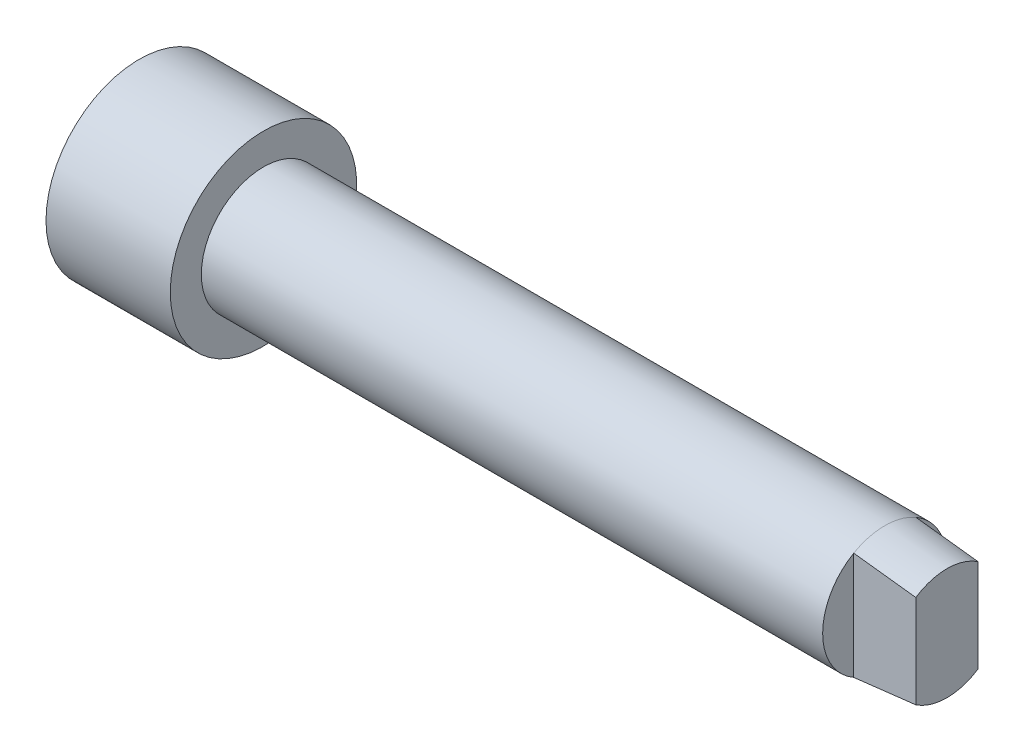
ISO-10303-21;
HEADER;
FILE_DESCRIPTION(('STEP AP214'),'2;1');
FILE_NAME('part.step','',(''),(''),'','','');
FILE_SCHEMA(('AUTOMOTIVE_DESIGN { 1 0 10303 214 1 1 1 1 }'));
ENDSEC;
DATA;
#1=APPLICATION_CONTEXT('core data for automotive mechanical design processes');
#2=APPLICATION_PROTOCOL_DEFINITION('international standard','automotive_design',2000,#1);
#3=PRODUCT_CONTEXT('',#1,'mechanical');
#4=PRODUCT('Part','Part','',(#3));
#5=PRODUCT_RELATED_PRODUCT_CATEGORY('part','',(#4));
#6=PRODUCT_DEFINITION_FORMATION('','',#4);
#7=PRODUCT_DEFINITION_CONTEXT('part definition',#1,'design');
#8=PRODUCT_DEFINITION('design','',#6,#7);
#9=PRODUCT_DEFINITION_SHAPE('','',#8);
#10=(LENGTH_UNIT() NAMED_UNIT(*) SI_UNIT(.MILLI.,.METRE.));
#11=(NAMED_UNIT(*) PLANE_ANGLE_UNIT() SI_UNIT($,.RADIAN.));
#12=(NAMED_UNIT(*) SI_UNIT($,.STERADIAN.) SOLID_ANGLE_UNIT());
#13=UNCERTAINTY_MEASURE_WITH_UNIT(LENGTH_MEASURE(1.E-05),#10,'distance_accuracy_value','');
#14=(GEOMETRIC_REPRESENTATION_CONTEXT(3) GLOBAL_UNCERTAINTY_ASSIGNED_CONTEXT((#13)) GLOBAL_UNIT_ASSIGNED_CONTEXT((#10,
#11,#12)) REPRESENTATION_CONTEXT('',''));
#15=CARTESIAN_POINT('',(0.,0.,0.));
#16=DIRECTION('',(0.,0.,1.));
#17=DIRECTION('',(1.,0.,0.));
#18=AXIS2_PLACEMENT_3D('',#15,#16,#17);
#19=CARTESIAN_POINT('',(55.,0.,0.));
#20=DIRECTION('',(-1.,0.,0.));
#21=DIRECTION('',(0.,0.,1.));
#22=AXIS2_PLACEMENT_3D('',#19,#20,#21);
#23=CONICAL_SURFACE('',#22,4.5,0.0996686524911636);
#24=CARTESIAN_POINT('',(55.,0.,0.));
#25=DIRECTION('',(-1.,0.,0.));
#26=DIRECTION('',(0.,0.,1.));
#27=AXIS2_PLACEMENT_3D('',#24,#25,#26);
#28=CIRCLE('',#27,4.5);
#29=CARTESIAN_POINT('',(55.,-3.74165738677394,-2.50000000000001));
#30=VERTEX_POINT('',#29);
#31=CARTESIAN_POINT('',(55.,-3.74165738677395,2.49999999999999));
#32=VERTEX_POINT('',#31);
#33=EDGE_CURVE('E89',#30,#32,#28,.T.);
#34=ORIENTED_EDGE('',*,*,#33,.T.);
#35=CARTESIAN_POINT('',(65.0001999999999,-2.4494611653178,2.49999999999999));
#36=CARTESIAN_POINT('',(64.4749435407986,-2.52447569539896,2.49999999999999));
#37=CARTESIAN_POINT('',(63.9494560098903,-2.59784481533977,2.49999999999999));
#38=CARTESIAN_POINT('',(62.8981166273628,-2.74189078796896,2.49999999999999));
#39=CARTESIAN_POINT('',(62.3722647792428,-2.81256766615924,2.49999999999999));
#40=CARTESIAN_POINT('',(60.7943327895488,-3.02145476573743,2.49999999999999));
#41=CARTESIAN_POINT('',(59.7418380059024,-3.1565268181458,2.49999999999999));
#42=CARTESIAN_POINT('',(57.9112128854687,-3.38645950666789,2.49999999999999));
#43=CARTESIAN_POINT('',(57.1332426060226,-3.48260612691608,2.49999999999999));
#44=CARTESIAN_POINT('',(55.5770043838344,-3.67246269226884,2.49999999999999));
#45=CARTESIAN_POINT('',(54.798736440944,-3.7661726361581,2.49999999999999));
#46=CARTESIAN_POINT('',(52.4635778959661,-4.04442185527334,2.49999999999999));
#47=CARTESIAN_POINT('',(50.9063443155223,-4.22607906049033,2.49999999999999));
#48=CARTESIAN_POINT('',(47.7911072144421,-4.58425936950015,2.49999999999999));
#49=CARTESIAN_POINT('',(46.2331036255329,-4.76078187638152,2.49999999999999));
#50=CARTESIAN_POINT('',(43.8958043537142,-5.02278340061679,2.49999999999999));
#51=CARTESIAN_POINT('',(43.1166641335528,-5.10965260163794,2.49999999999999));
#52=CARTESIAN_POINT('',(41.5582950701217,-5.28258730841878,2.49999999999999));
#53=CARTESIAN_POINT('',(40.7790662269183,-5.36865281477517,2.49999999999999));
#54=CARTESIAN_POINT('',(39.9998,-5.45437805807411,2.49999999999999));
#55=B_SPLINE_CURVE_WITH_KNOTS('',3,(#35,#36,#37,#38,#39,#40,#41,#42,#43,#44,#45,#46,#47,#48,#49,
#50,#51,#52,#53,#54),.UNSPECIFIED.,.F.,.F.,(4,2,2,2,2,2,2,2,2,4),(0.,1.59174972343537,
3.18348436548473,6.36683793818173,8.71850162774362,11.0701664901972,15.773531698894,
20.4774415087323,22.8293449960982,25.1812467371549),.UNSPECIFIED.);
#56=CARTESIAN_POINT('',(50.,-4.3301270189222,2.49999999999999));
#57=VERTEX_POINT('',#56);
#58=EDGE_CURVE('E11',#32,#57,#55,.T.);
#59=ORIENTED_EDGE('',*,*,#58,.T.);
#60=CARTESIAN_POINT('',(50.,0.,0.));
#61=DIRECTION('',(-1.,0.,0.));
#62=DIRECTION('',(0.,0.,1.));
#63=AXIS2_PLACEMENT_3D('',#60,#61,#62);
#64=CIRCLE('',#63,5.00000000000001);
#65=CARTESIAN_POINT('',(50.,-4.3301270189222,-2.50000000000001));
#66=VERTEX_POINT('',#65);
#67=EDGE_CURVE('E92',#66,#57,#64,.T.);
#68=ORIENTED_EDGE('',*,*,#67,.F.);
#69=CARTESIAN_POINT('',(39.9998,-5.4543780580741,-2.50000000000001));
#70=CARTESIAN_POINT('',(40.9038725033854,-5.35491825333048,-2.50000000000001));
#71=CARTESIAN_POINT('',(41.8078957002148,-5.25500786077288,-2.50000000000001));
#72=CARTESIAN_POINT('',(43.6158161844281,-5.05407832495295,-2.50000000000001));
#73=CARTESIAN_POINT('',(44.5197134721681,-4.95305918489185,-2.50000000000001));
#74=CARTESIAN_POINT('',(46.3273259236675,-4.74970784760197,-2.50000000000001));
#75=CARTESIAN_POINT('',(47.2310410930163,-4.64737570011188,-2.50000000000001));
#76=CARTESIAN_POINT('',(49.0382916973535,-4.44110674785506,-2.50000000000001));
#77=CARTESIAN_POINT('',(49.9418271316897,-4.33716993737019,-2.50000000000001));
#78=CARTESIAN_POINT('',(52.0262048810422,-4.09508617313362,-2.50000000000001));
#79=CARTESIAN_POINT('',(53.2069660027046,-3.95623873850152,-2.50000000000001));
#80=CARTESIAN_POINT('',(55.567935275544,-3.67397661673595,-2.50000000000001));
#81=CARTESIAN_POINT('',(56.7481434312414,-3.53056196762455,-2.50000000000001));
#82=CARTESIAN_POINT('',(58.5178772253509,-3.31052053745637,-2.50000000000001));
#83=CARTESIAN_POINT('',(59.107708243208,-3.23635138419482,-2.50000000000001));
#84=CARTESIAN_POINT('',(60.2871103319202,-3.08598621654604,-2.50000000000001));
#85=CARTESIAN_POINT('',(60.8766814035918,-3.00979020857111,-2.50000000000001));
#86=CARTESIAN_POINT('',(62.0555127685322,-2.85488940355147,-2.50000000000001));
#87=CARTESIAN_POINT('',(62.6447730523151,-2.77618453397962,-2.50000000000001));
#88=CARTESIAN_POINT('',(63.8228507001902,-2.61548529680488,-2.50000000000001));
#89=CARTESIAN_POINT('',(64.4116680593866,-2.53349089337059,-2.50000000000001));
#90=CARTESIAN_POINT('',(65.0002,-2.44946116531777,-2.50000000000001));
#91=B_SPLINE_CURVE_WITH_KNOTS('',3,(#69,#70,#71,#72,#73,#74,#75,#76,#77,#78,#79,#80,#81,#82,#83,
#84,#85,#86,#87,#88,#89,#90),.UNSPECIFIED.,.F.,.F.,(4,2,2,2,2,2,2,2,2,2,4),(0.,2.72858124381777,
5.45715461159512,8.18562492029478,10.9141049540058,14.4807894298532,18.0474442207944,
19.8308693886533,21.6142889150244,23.3977600440187,25.1812506048407),.UNSPECIFIED.);
#92=EDGE_CURVE('E111',#66,#30,#91,.T.);
#93=ORIENTED_EDGE('',*,*,#92,.T.);
#94=EDGE_LOOP('',(#34,#59,#68,#93));
#95=FACE_BOUND('',#94,.T.);
#96=ADVANCED_FACE('F36',(#95),#23,.T.);
#97=CARTESIAN_POINT('',(-5.,0.,0.));
#98=DIRECTION('',(1.,0.,0.));
#99=DIRECTION('',(0.,0.,-1.));
#100=AXIS2_PLACEMENT_3D('',#97,#98,#99);
#101=PLANE('',#100);
#102=CARTESIAN_POINT('',(-5.,0.,0.));
#103=DIRECTION('',(-1.,0.,0.));
#104=DIRECTION('',(0.,0.,1.));
#105=AXIS2_PLACEMENT_3D('',#102,#103,#104);
#106=CIRCLE('',#105,5.);
#107=CARTESIAN_POINT('',(-5.,0.,5.));
#108=VERTEX_POINT('',#107);
#109=EDGE_CURVE('E94',#108,#108,#106,.T.);
#110=ORIENTED_EDGE('',*,*,#109,.T.);
#111=EDGE_LOOP('',(#110));
#112=FACE_BOUND('',#111,.T.);
#113=ADVANCED_FACE('F38',(#112),#101,.F.);
#114=CARTESIAN_POINT('',(55.,0.,0.));
#115=DIRECTION('',(-1.,0.,0.));
#116=DIRECTION('',(0.,0.,1.));
#117=AXIS2_PLACEMENT_3D('',#114,#115,#116);
#118=PLANE('',#117);
#119=CARTESIAN_POINT('',(55.,3.74165738677395,2.49999999999999));
#120=VERTEX_POINT('',#119);
#121=CARTESIAN_POINT('',(55.,3.74165738677394,-2.50000000000001));
#122=VERTEX_POINT('',#121);
#123=EDGE_CURVE('E108',#120,#122,#28,.T.);
#124=ORIENTED_EDGE('',*,*,#123,.F.);
#125=DIRECTION('',(0.,1.,0.));
#126=VECTOR('',#125,1.);
#127=CARTESIAN_POINT('',(55.,-4.3301270189222,2.49999999999999));
#128=LINE('',#127,#126);
#129=EDGE_CURVE('E65',#32,#120,#128,.T.);
#130=ORIENTED_EDGE('',*,*,#129,.F.);
#131=ORIENTED_EDGE('',*,*,#33,.F.);
#132=DIRECTION('',(0.,-1.,0.));
#133=VECTOR('',#132,1.);
#134=CARTESIAN_POINT('',(55.,4.3301270189222,-2.50000000000001));
#135=LINE('',#134,#133);
#136=EDGE_CURVE('E174',#122,#30,#135,.T.);
#137=ORIENTED_EDGE('',*,*,#136,.F.);
#138=EDGE_LOOP('',(#124,#130,#131,#137));
#139=FACE_BOUND('',#138,.T.);
#140=ADVANCED_FACE('F154',(#139),#118,.F.);
#141=CARTESIAN_POINT('',(50.,4.3301270189222,2.49999999999999));
#142=VERTEX_POINT('',#141);
#143=CARTESIAN_POINT('',(50.,4.3301270189222,-2.50000000000001));
#144=VERTEX_POINT('',#143);
#145=EDGE_CURVE('E90',#142,#144,#64,.T.);
#146=ORIENTED_EDGE('',*,*,#145,.F.);
#147=CARTESIAN_POINT('',(39.9998,5.45437805807411,2.49999999999999));
#148=CARTESIAN_POINT('',(40.9038725033854,5.35491825333049,2.49999999999999));
#149=CARTESIAN_POINT('',(41.8078957002148,5.25500786077289,2.49999999999999));
#150=CARTESIAN_POINT('',(43.6158161844281,5.05407832495296,2.49999999999999));
#151=CARTESIAN_POINT('',(44.5197134721681,4.95305918489186,2.49999999999999));
#152=CARTESIAN_POINT('',(46.3273259236675,4.74970784760198,2.49999999999999));
#153=CARTESIAN_POINT('',(47.2310410930163,4.64737570011189,2.49999999999999));
#154=CARTESIAN_POINT('',(49.0382916973535,4.44110674785507,2.49999999999999));
#155=CARTESIAN_POINT('',(49.9418271316897,4.3371699373702,2.49999999999999));
#156=CARTESIAN_POINT('',(52.0262048810422,4.09508617313362,2.49999999999999));
#157=CARTESIAN_POINT('',(53.2069660027046,3.95623873850154,2.49999999999999));
#158=CARTESIAN_POINT('',(55.5679352755439,3.67397661673596,2.49999999999999));
#159=CARTESIAN_POINT('',(56.7481434312413,3.53056196762456,2.49999999999999));
#160=CARTESIAN_POINT('',(58.5178772253508,3.31052053745639,2.49999999999999));
#161=CARTESIAN_POINT('',(59.1077082432079,3.23635138419484,2.49999999999999));
#162=CARTESIAN_POINT('',(60.2871103319201,3.08598621654607,2.49999999999999));
#163=CARTESIAN_POINT('',(60.8766814035917,3.00979020857114,2.49999999999999));
#164=CARTESIAN_POINT('',(62.0555127685321,2.8548894035515,2.49999999999999));
#165=CARTESIAN_POINT('',(62.644773052315,2.77618453397965,2.49999999999999));
#166=CARTESIAN_POINT('',(63.8228507001901,2.61548529680492,2.49999999999999));
#167=CARTESIAN_POINT('',(64.4116680593864,2.53349089337062,2.49999999999999));
#168=CARTESIAN_POINT('',(65.0001999999999,2.44946116531781,2.49999999999999));
#169=B_SPLINE_CURVE_WITH_KNOTS('',3,(#147,#148,#149,#150,#151,#152,#153,#154,#155,#156,#157,
#158,#159,#160,#161,#162,#163,#164,#165,#166,#167,#168),.UNSPECIFIED.,.F.,.F.,(4,2,2,2,2,2,2,2,
2,2,4),(0.,2.72858124381777,5.45715461159512,8.18562492029478,10.9141049540058,14.4807894298532,
18.0474442207943,19.8308693886532,21.6142889150243,23.3977600440186,25.1812506048405),.UNSPECIFIED.);
#170=EDGE_CURVE('E50',#142,#120,#169,.T.);
#171=ORIENTED_EDGE('',*,*,#170,.T.);
#172=ORIENTED_EDGE('',*,*,#123,.T.);
#173=CARTESIAN_POINT('',(65.0002,2.44946116531776,-2.50000000000001));
#174=CARTESIAN_POINT('',(64.4749435407988,2.52447569539893,-2.50000000000001));
#175=CARTESIAN_POINT('',(63.9494560098904,2.59784481533973,-2.50000000000001));
#176=CARTESIAN_POINT('',(62.898116627363,2.74189078796893,-2.50000000000001));
#177=CARTESIAN_POINT('',(62.3722647792429,2.81256766615921,-2.50000000000001));
#178=CARTESIAN_POINT('',(60.7943327895489,3.0214547657374,-2.50000000000001));
#179=CARTESIAN_POINT('',(59.7418380059026,3.15652681814577,-2.50000000000001));
#180=CARTESIAN_POINT('',(57.9112128854688,3.38645950666786,-2.50000000000001));
#181=CARTESIAN_POINT('',(57.1332426060227,3.48260612691605,-2.50000000000001));
#182=CARTESIAN_POINT('',(55.5770043838345,3.67246269226881,-2.50000000000001));
#183=CARTESIAN_POINT('',(54.7987364409442,3.76617263615807,-2.50000000000001));
#184=CARTESIAN_POINT('',(52.4635778959663,4.04442185527331,-2.50000000000001));
#185=CARTESIAN_POINT('',(50.9063443155224,4.22607906049031,-2.50000000000001));
#186=CARTESIAN_POINT('',(47.7911072144422,4.58425936950014,-2.50000000000001));
#187=CARTESIAN_POINT('',(46.2331036255329,4.7607818763815,-2.50000000000001));
#188=CARTESIAN_POINT('',(43.8958043537142,5.02278340061678,-2.50000000000001));
#189=CARTESIAN_POINT('',(43.1166641335529,5.10965260163793,-2.50000000000001));
#190=CARTESIAN_POINT('',(41.5582950701218,5.28258730841877,-2.50000000000001));
#191=CARTESIAN_POINT('',(40.7790662269183,5.36865281477516,-2.50000000000001));
#192=CARTESIAN_POINT('',(39.9998,5.4543780580741,-2.50000000000001));
#193=B_SPLINE_CURVE_WITH_KNOTS('',3,(#173,#174,#175,#176,#177,#178,#179,#180,#181,#182,#183,
#184,#185,#186,#187,#188,#189,#190,#191,#192),.UNSPECIFIED.,.F.,.F.,(4,2,2,2,2,2,2,2,2,4),(0.,
1.59174972343537,3.18348436548471,6.3668379381817,8.71850162774362,11.0701664901972,
15.773531698894,20.4774415087324,22.8293449960983,25.1812467371551),.UNSPECIFIED.);
#194=EDGE_CURVE('E118',#122,#144,#193,.T.);
#195=ORIENTED_EDGE('',*,*,#194,.T.);
#196=EDGE_LOOP('',(#146,#171,#172,#195));
#197=FACE_BOUND('',#196,.T.);
#198=ADVANCED_FACE('F123',(#197),#23,.T.);
#199=CARTESIAN_POINT('',(0.,0.,0.));
#200=DIRECTION('',(-1.,0.,0.));
#201=DIRECTION('',(0.,0.,1.));
#202=AXIS2_PLACEMENT_3D('',#199,#200,#201);
#203=CYLINDRICAL_SURFACE('',#202,5.);
#204=CARTESIAN_POINT('',(0.,0.,0.));
#205=DIRECTION('',(-1.,0.,0.));
#206=DIRECTION('',(0.,0.,1.));
#207=AXIS2_PLACEMENT_3D('',#204,#205,#206);
#208=CIRCLE('',#207,5.);
#209=CARTESIAN_POINT('',(0.,0.,5.));
#210=VERTEX_POINT('',#209);
#211=EDGE_CURVE('E102',#210,#210,#208,.T.);
#212=ORIENTED_EDGE('',*,*,#211,.F.);
#213=EDGE_LOOP('',(#212));
#214=FACE_BOUND('',#213,.T.);
#215=EDGE_CURVE('E84',#57,#142,#64,.T.);
#216=ORIENTED_EDGE('',*,*,#215,.T.);
#217=ORIENTED_EDGE('',*,*,#145,.T.);
#218=EDGE_CURVE('E57',#144,#66,#64,.T.);
#219=ORIENTED_EDGE('',*,*,#218,.T.);
#220=ORIENTED_EDGE('',*,*,#67,.T.);
#221=EDGE_LOOP('',(#216,#217,#219,#220));
#222=FACE_BOUND('',#221,.T.);
#223=ADVANCED_FACE('F101',(#214,#222),#203,.T.);
#224=CARTESIAN_POINT('',(0.,0.,0.));
#225=DIRECTION('',(1.,0.,0.));
#226=DIRECTION('',(0.,0.,-1.));
#227=AXIS2_PLACEMENT_3D('',#224,#225,#226);
#228=PLANE('',#227);
#229=ORIENTED_EDGE('',*,*,#211,.T.);
#230=EDGE_LOOP('',(#229));
#231=FACE_BOUND('',#230,.T.);
#232=CARTESIAN_POINT('',(0.,0.,0.));
#233=DIRECTION('',(-1.,0.,0.));
#234=DIRECTION('',(0.,0.,1.));
#235=AXIS2_PLACEMENT_3D('',#232,#233,#234);
#236=CIRCLE('',#235,7.5);
#237=CARTESIAN_POINT('',(0.,0.,7.5));
#238=VERTEX_POINT('',#237);
#239=EDGE_CURVE('E104',#238,#238,#236,.T.);
#240=ORIENTED_EDGE('',*,*,#239,.F.);
#241=EDGE_LOOP('',(#240));
#242=FACE_BOUND('',#241,.T.);
#243=ADVANCED_FACE('F145',(#231,#242),#228,.T.);
#244=CARTESIAN_POINT('',(0.,0.,0.));
#245=DIRECTION('',(-1.,0.,0.));
#246=DIRECTION('',(0.,0.,1.));
#247=AXIS2_PLACEMENT_3D('',#244,#245,#246);
#248=CYLINDRICAL_SURFACE('',#247,7.5);
#249=CARTESIAN_POINT('',(-10.,0.,0.));
#250=DIRECTION('',(-1.,0.,0.));
#251=DIRECTION('',(0.,0.,1.));
#252=AXIS2_PLACEMENT_3D('',#249,#250,#251);
#253=CIRCLE('',#252,7.5);
#254=CARTESIAN_POINT('',(-10.,0.,7.5));
#255=VERTEX_POINT('',#254);
#256=EDGE_CURVE('E171',#255,#255,#253,.T.);
#257=ORIENTED_EDGE('',*,*,#256,.F.);
#258=EDGE_LOOP('',(#257));
#259=FACE_BOUND('',#258,.T.);
#260=ORIENTED_EDGE('',*,*,#239,.T.);
#261=EDGE_LOOP('',(#260));
#262=FACE_BOUND('',#261,.T.);
#263=ADVANCED_FACE('F141',(#259,#262),#248,.T.);
#264=CARTESIAN_POINT('',(-10.,0.,0.));
#265=DIRECTION('',(1.,0.,0.));
#266=DIRECTION('',(0.,0.,-1.));
#267=AXIS2_PLACEMENT_3D('',#264,#265,#266);
#268=PLANE('',#267);
#269=CARTESIAN_POINT('',(-10.,0.,0.));
#270=DIRECTION('',(-1.,0.,0.));
#271=DIRECTION('',(0.,0.,1.));
#272=AXIS2_PLACEMENT_3D('',#269,#270,#271);
#273=CIRCLE('',#272,5.);
#274=CARTESIAN_POINT('',(-10.,0.,5.));
#275=VERTEX_POINT('',#274);
#276=EDGE_CURVE('E168',#275,#275,#273,.T.);
#277=ORIENTED_EDGE('',*,*,#276,.F.);
#278=EDGE_LOOP('',(#277));
#279=FACE_BOUND('',#278,.T.);
#280=ORIENTED_EDGE('',*,*,#256,.T.);
#281=EDGE_LOOP('',(#280));
#282=FACE_BOUND('',#281,.T.);
#283=ADVANCED_FACE('F137',(#279,#282),#268,.F.);
#284=CARTESIAN_POINT('',(0.,0.,0.));
#285=DIRECTION('',(-1.,0.,0.));
#286=DIRECTION('',(0.,0.,1.));
#287=AXIS2_PLACEMENT_3D('',#284,#285,#286);
#288=CYLINDRICAL_SURFACE('',#287,5.);
#289=ORIENTED_EDGE('',*,*,#109,.F.);
#290=EDGE_LOOP('',(#289));
#291=FACE_BOUND('',#290,.T.);
#292=ORIENTED_EDGE('',*,*,#276,.T.);
#293=EDGE_LOOP('',(#292));
#294=FACE_BOUND('',#293,.T.);
#295=ADVANCED_FACE('F132',(#291,#294),#288,.F.);
#296=CARTESIAN_POINT('',(50.,4.3301270189222,-2.50000000000001));
#297=DIRECTION('',(0.,0.,1.));
#298=DIRECTION('',(1.,0.,0.));
#299=AXIS2_PLACEMENT_3D('',#296,#297,#298);
#300=PLANE('',#299);
#301=ORIENTED_EDGE('',*,*,#136,.T.);
#302=ORIENTED_EDGE('',*,*,#92,.F.);
#303=DIRECTION('',(0.,-1.,0.));
#304=VECTOR('',#303,1.);
#305=CARTESIAN_POINT('',(50.,4.3301270189222,-2.50000000000001));
#306=LINE('',#305,#304);
#307=EDGE_CURVE('E184',#144,#66,#306,.T.);
#308=ORIENTED_EDGE('',*,*,#307,.F.);
#309=ORIENTED_EDGE('',*,*,#194,.F.);
#310=EDGE_LOOP('',(#301,#302,#308,#309));
#311=FACE_BOUND('',#310,.T.);
#312=ADVANCED_FACE('F126',(#311),#300,.F.);
#313=CARTESIAN_POINT('',(50.,0.,0.));
#314=DIRECTION('',(-1.,0.,0.));
#315=DIRECTION('',(0.,0.,1.));
#316=AXIS2_PLACEMENT_3D('',#313,#314,#315);
#317=PLANE('',#316);
#318=ORIENTED_EDGE('',*,*,#307,.T.);
#319=ORIENTED_EDGE('',*,*,#218,.F.);
#320=EDGE_LOOP('',(#318,#319));
#321=FACE_BOUND('',#320,.T.);
#322=ADVANCED_FACE('F131',(#321),#317,.F.);
#323=CARTESIAN_POINT('',(50.,-4.3301270189222,2.49999999999999));
#324=DIRECTION('',(0.,0.,-1.));
#325=DIRECTION('',(-1.,0.,0.));
#326=AXIS2_PLACEMENT_3D('',#323,#324,#325);
#327=PLANE('',#326);
#328=ORIENTED_EDGE('',*,*,#129,.T.);
#329=ORIENTED_EDGE('',*,*,#170,.F.);
#330=DIRECTION('',(0.,1.,0.));
#331=VECTOR('',#330,1.);
#332=CARTESIAN_POINT('',(50.,-4.3301270189222,2.49999999999999));
#333=LINE('',#332,#331);
#334=EDGE_CURVE('E87',#57,#142,#333,.T.);
#335=ORIENTED_EDGE('',*,*,#334,.F.);
#336=ORIENTED_EDGE('',*,*,#58,.F.);
#337=EDGE_LOOP('',(#328,#329,#335,#336));
#338=FACE_BOUND('',#337,.T.);
#339=ADVANCED_FACE('F93',(#338),#327,.F.);
#340=CARTESIAN_POINT('',(50.,0.,0.));
#341=DIRECTION('',(-1.,0.,0.));
#342=DIRECTION('',(0.,0.,1.));
#343=AXIS2_PLACEMENT_3D('',#340,#341,#342);
#344=PLANE('',#343);
#345=ORIENTED_EDGE('',*,*,#215,.F.);
#346=ORIENTED_EDGE('',*,*,#334,.T.);
#347=EDGE_LOOP('',(#345,#346));
#348=FACE_BOUND('',#347,.T.);
#349=ADVANCED_FACE('F86',(#348),#344,.F.);
#350=CLOSED_SHELL('',(#96,#113,#140,#198,#223,#243,#263,#283,#295,#312,#322,#339,#349));
#351=MANIFOLD_SOLID_BREP('B2',#350);
#352=ADVANCED_BREP_SHAPE_REPRESENTATION('',(#18,#351),#14);
#353=SHAPE_DEFINITION_REPRESENTATION(#9,#352);
ENDSEC;
END-ISO-10303-21;
